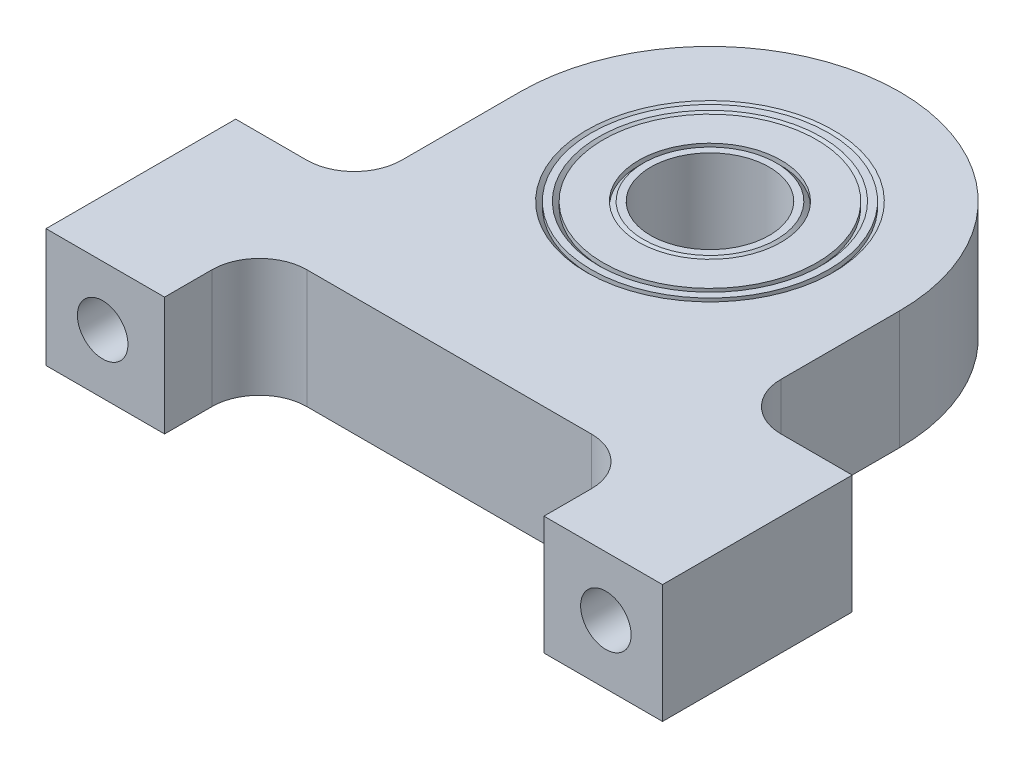
ISO-10303-21;
HEADER;
FILE_DESCRIPTION(('STEP AP214'),'2;1');
FILE_NAME('part.step','',(''),(''),'','','');
FILE_SCHEMA(('AUTOMOTIVE_DESIGN { 1 0 10303 214 1 1 1 1 }'));
ENDSEC;
DATA;
#1=APPLICATION_CONTEXT('core data for automotive mechanical design processes');
#2=APPLICATION_PROTOCOL_DEFINITION('international standard','automotive_design',2000,#1);
#3=PRODUCT_CONTEXT('',#1,'mechanical');
#4=PRODUCT('Part','Part','',(#3));
#5=PRODUCT_RELATED_PRODUCT_CATEGORY('part','',(#4));
#6=PRODUCT_DEFINITION_FORMATION('','',#4);
#7=PRODUCT_DEFINITION_CONTEXT('part definition',#1,'design');
#8=PRODUCT_DEFINITION('design','',#6,#7);
#9=PRODUCT_DEFINITION_SHAPE('','',#8);
#10=(LENGTH_UNIT() NAMED_UNIT(*) SI_UNIT(.MILLI.,.METRE.));
#11=(NAMED_UNIT(*) PLANE_ANGLE_UNIT() SI_UNIT($,.RADIAN.));
#12=(NAMED_UNIT(*) SI_UNIT($,.STERADIAN.) SOLID_ANGLE_UNIT());
#13=UNCERTAINTY_MEASURE_WITH_UNIT(LENGTH_MEASURE(1.E-05),#10,'distance_accuracy_value','');
#14=(GEOMETRIC_REPRESENTATION_CONTEXT(3) GLOBAL_UNCERTAINTY_ASSIGNED_CONTEXT((#13)) GLOBAL_UNIT_ASSIGNED_CONTEXT((#10,
#11,#12)) REPRESENTATION_CONTEXT('',''));
#15=CARTESIAN_POINT('',(0.,0.,0.));
#16=DIRECTION('',(0.,0.,1.));
#17=DIRECTION('',(1.,0.,0.));
#18=AXIS2_PLACEMENT_3D('',#15,#16,#17);
#19=CARTESIAN_POINT('',(0.,6.35,0.));
#20=DIRECTION('',(0.,-1.,0.));
#21=DIRECTION('',(0.,0.,-1.));
#22=AXIS2_PLACEMENT_3D('',#19,#20,#21);
#23=CYLINDRICAL_SURFACE('',#22,3.81);
#24=CARTESIAN_POINT('',(0.,1.8415,0.));
#25=DIRECTION('',(0.,1.,0.));
#26=DIRECTION('',(0.,0.,1.));
#27=AXIS2_PLACEMENT_3D('',#24,#25,#26);
#28=CIRCLE('',#27,3.81);
#29=CARTESIAN_POINT('',(0.,1.8415,3.81));
#30=VERTEX_POINT('',#29);
#31=EDGE_CURVE('E61',#30,#30,#28,.T.);
#32=ORIENTED_EDGE('',*,*,#31,.T.);
#33=EDGE_LOOP('',(#32));
#34=FACE_BOUND('',#33,.T.);
#35=CARTESIAN_POINT('',(0.,2.0955,0.));
#36=DIRECTION('',(0.,1.,0.));
#37=DIRECTION('',(0.,0.,1.));
#38=AXIS2_PLACEMENT_3D('',#35,#36,#37);
#39=CIRCLE('',#38,3.81);
#40=CARTESIAN_POINT('',(0.,2.0955,3.81));
#41=VERTEX_POINT('',#40);
#42=EDGE_CURVE('E11',#41,#41,#39,.T.);
#43=ORIENTED_EDGE('',*,*,#42,.F.);
#44=EDGE_LOOP('',(#43));
#45=FACE_BOUND('',#44,.T.);
#46=ADVANCED_FACE('F46',(#34,#45),#23,.T.);
#47=CARTESIAN_POINT('',(0.,6.35,0.));
#48=DIRECTION('',(0.,1.,0.));
#49=DIRECTION('',(0.,0.,1.));
#50=AXIS2_PLACEMENT_3D('',#47,#48,#49);
#51=PLANE('',#50);
#52=CARTESIAN_POINT('',(0.,6.35,0.));
#53=DIRECTION('',(0.,1.,0.));
#54=DIRECTION('',(0.,0.,1.));
#55=AXIS2_PLACEMENT_3D('',#52,#53,#54);
#56=CIRCLE('',#55,3.55600000000001);
#57=CARTESIAN_POINT('',(0.,6.35,3.55600000000001));
#58=VERTEX_POINT('',#57);
#59=EDGE_CURVE('E53',#58,#58,#56,.T.);
#60=ORIENTED_EDGE('',*,*,#59,.T.);
#61=EDGE_LOOP('',(#60));
#62=FACE_BOUND('',#61,.T.);
#63=CARTESIAN_POINT('',(0.,6.35,0.));
#64=DIRECTION('',(0.,1.,0.));
#65=DIRECTION('',(0.,0.,1.));
#66=AXIS2_PLACEMENT_3D('',#63,#64,#65);
#67=CIRCLE('',#66,3.175);
#68=CARTESIAN_POINT('',(0.,6.35,3.175));
#69=VERTEX_POINT('',#68);
#70=EDGE_CURVE('E69',#69,#69,#67,.T.);
#71=ORIENTED_EDGE('',*,*,#70,.F.);
#72=EDGE_LOOP('',(#71));
#73=FACE_BOUND('',#72,.T.);
#74=ADVANCED_FACE('F107',(#62,#73),#51,.T.);
#75=CARTESIAN_POINT('',(0.,1.5875,0.));
#76=DIRECTION('',(0.,1.,0.));
#77=DIRECTION('',(0.,0.,1.));
#78=AXIS2_PLACEMENT_3D('',#75,#76,#77);
#79=PLANE('',#78);
#80=CARTESIAN_POINT('',(0.,1.5875,0.));
#81=DIRECTION('',(0.,1.,0.));
#82=DIRECTION('',(0.,0.,1.));
#83=AXIS2_PLACEMENT_3D('',#80,#81,#82);
#84=CIRCLE('',#83,3.55599999999999);
#85=CARTESIAN_POINT('',(0.,1.5875,3.55599999999999));
#86=VERTEX_POINT('',#85);
#87=EDGE_CURVE('E57',#86,#86,#84,.F.);
#88=ORIENTED_EDGE('',*,*,#87,.T.);
#89=EDGE_LOOP('',(#88));
#90=FACE_BOUND('',#89,.T.);
#91=CARTESIAN_POINT('',(0.,1.5875,0.));
#92=DIRECTION('',(0.,1.,0.));
#93=DIRECTION('',(0.,0.,1.));
#94=AXIS2_PLACEMENT_3D('',#91,#92,#93);
#95=CIRCLE('',#94,3.175);
#96=CARTESIAN_POINT('',(0.,1.5875,3.175));
#97=VERTEX_POINT('',#96);
#98=EDGE_CURVE('E70',#97,#97,#95,.T.);
#99=ORIENTED_EDGE('',*,*,#98,.T.);
#100=EDGE_LOOP('',(#99));
#101=FACE_BOUND('',#100,.T.);
#102=ADVANCED_FACE('F113',(#90,#101),#79,.F.);
#103=CARTESIAN_POINT('',(0.,6.35,0.));
#104=DIRECTION('',(0.,-1.,0.));
#105=DIRECTION('',(0.,0.,-1.));
#106=AXIS2_PLACEMENT_3D('',#103,#104,#105);
#107=CYLINDRICAL_SURFACE('',#106,3.175);
#108=ORIENTED_EDGE('',*,*,#70,.T.);
#109=EDGE_LOOP('',(#108));
#110=FACE_BOUND('',#109,.T.);
#111=ORIENTED_EDGE('',*,*,#98,.F.);
#112=EDGE_LOOP('',(#111));
#113=FACE_BOUND('',#112,.T.);
#114=ADVANCED_FACE('F118',(#110,#113),#107,.F.);
#115=CARTESIAN_POINT('',(0.,1.8415,0.));
#116=DIRECTION('',(0.,1.,0.));
#117=DIRECTION('',(0.,0.,1.));
#118=AXIS2_PLACEMENT_3D('',#115,#116,#117);
#119=CONICAL_SURFACE('',#118,3.81,0.785398163397449);
#120=ORIENTED_EDGE('',*,*,#87,.F.);
#121=EDGE_LOOP('',(#120));
#122=FACE_BOUND('',#121,.T.);
#123=ORIENTED_EDGE('',*,*,#31,.F.);
#124=EDGE_LOOP('',(#123));
#125=FACE_BOUND('',#124,.T.);
#126=ADVANCED_FACE('F103',(#122,#125),#119,.T.);
#127=CARTESIAN_POINT('',(0.,6.35,0.));
#128=DIRECTION('',(0.,-1.,0.));
#129=DIRECTION('',(0.,0.,-1.));
#130=AXIS2_PLACEMENT_3D('',#127,#128,#129);
#131=CONICAL_SURFACE('',#130,3.55600000000001,0.785398163397447);
#132=CARTESIAN_POINT('',(0.,6.09600000000001,0.));
#133=DIRECTION('',(0.,1.,0.));
#134=DIRECTION('',(0.,0.,1.));
#135=AXIS2_PLACEMENT_3D('',#132,#133,#134);
#136=CIRCLE('',#135,3.81);
#137=CARTESIAN_POINT('',(0.,6.09600000000001,3.81));
#138=VERTEX_POINT('',#137);
#139=EDGE_CURVE('E66',#138,#138,#136,.F.);
#140=ORIENTED_EDGE('',*,*,#139,.F.);
#141=EDGE_LOOP('',(#140));
#142=FACE_BOUND('',#141,.T.);
#143=ORIENTED_EDGE('',*,*,#59,.F.);
#144=EDGE_LOOP('',(#143));
#145=FACE_BOUND('',#144,.T.);
#146=ADVANCED_FACE('F48',(#142,#145),#131,.T.);
#147=CARTESIAN_POINT('',(0.,2.0955,0.));
#148=DIRECTION('',(0.,1.,0.));
#149=DIRECTION('',(0.,0.,1.));
#150=AXIS2_PLACEMENT_3D('',#147,#148,#149);
#151=CYLINDRICAL_SURFACE('',#150,5.715);
#152=CARTESIAN_POINT('',(0.,2.0955,0.));
#153=DIRECTION('',(0.,1.,0.));
#154=DIRECTION('',(0.,0.,1.));
#155=AXIS2_PLACEMENT_3D('',#152,#153,#154);
#156=CIRCLE('',#155,5.715);
#157=CARTESIAN_POINT('',(0.,2.0955,5.715));
#158=VERTEX_POINT('',#157);
#159=EDGE_CURVE('E73',#158,#158,#156,.T.);
#160=ORIENTED_EDGE('',*,*,#159,.T.);
#161=EDGE_LOOP('',(#160));
#162=FACE_BOUND('',#161,.T.);
#163=CARTESIAN_POINT('',(0.,6.35,0.));
#164=DIRECTION('',(0.,1.,0.));
#165=DIRECTION('',(0.,0.,1.));
#166=AXIS2_PLACEMENT_3D('',#163,#164,#165);
#167=CIRCLE('',#166,5.715);
#168=CARTESIAN_POINT('',(0.,6.35,5.715));
#169=VERTEX_POINT('',#168);
#170=EDGE_CURVE('E76',#169,#169,#167,.T.);
#171=ORIENTED_EDGE('',*,*,#170,.F.);
#172=EDGE_LOOP('',(#171));
#173=FACE_BOUND('',#172,.T.);
#174=ADVANCED_FACE('F94',(#162,#173),#151,.T.);
#175=CARTESIAN_POINT('',(0.,2.0955,0.));
#176=DIRECTION('',(0.,1.,0.));
#177=DIRECTION('',(0.,0.,1.));
#178=AXIS2_PLACEMENT_3D('',#175,#176,#177);
#179=PLANE('',#178);
#180=ORIENTED_EDGE('',*,*,#42,.T.);
#181=EDGE_LOOP('',(#180));
#182=FACE_BOUND('',#181,.T.);
#183=ORIENTED_EDGE('',*,*,#159,.F.);
#184=EDGE_LOOP('',(#183));
#185=FACE_BOUND('',#184,.T.);
#186=ADVANCED_FACE('F90',(#182,#185),#179,.F.);
#187=CARTESIAN_POINT('',(0.,6.35,0.));
#188=DIRECTION('',(0.,1.,0.));
#189=DIRECTION('',(0.,0.,1.));
#190=AXIS2_PLACEMENT_3D('',#187,#188,#189);
#191=PLANE('',#190);
#192=CARTESIAN_POINT('',(0.,6.35,0.));
#193=DIRECTION('',(0.,1.,0.));
#194=DIRECTION('',(0.,0.,1.));
#195=AXIS2_PLACEMENT_3D('',#192,#193,#194);
#196=CIRCLE('',#195,3.81);
#197=CARTESIAN_POINT('',(0.,6.35,3.81));
#198=VERTEX_POINT('',#197);
#199=EDGE_CURVE('E79',#198,#198,#196,.T.);
#200=ORIENTED_EDGE('',*,*,#199,.F.);
#201=EDGE_LOOP('',(#200));
#202=FACE_BOUND('',#201,.T.);
#203=ORIENTED_EDGE('',*,*,#170,.T.);
#204=EDGE_LOOP('',(#203));
#205=FACE_BOUND('',#204,.T.);
#206=ADVANCED_FACE('F87',(#202,#205),#191,.T.);
#207=CARTESIAN_POINT('',(0.,2.0955,0.));
#208=DIRECTION('',(0.,1.,0.));
#209=DIRECTION('',(0.,0.,1.));
#210=AXIS2_PLACEMENT_3D('',#207,#208,#209);
#211=CYLINDRICAL_SURFACE('',#210,3.81);
#212=ORIENTED_EDGE('',*,*,#139,.T.);
#213=EDGE_LOOP('',(#212));
#214=FACE_BOUND('',#213,.T.);
#215=ORIENTED_EDGE('',*,*,#199,.T.);
#216=EDGE_LOOP('',(#215));
#217=FACE_BOUND('',#216,.T.);
#218=ADVANCED_FACE('F85',(#214,#217),#211,.F.);
#219=CLOSED_SHELL('',(#46,#74,#102,#114,#126,#146,#174,#186,#206,#218));
#220=MANIFOLD_SOLID_BREP('B2',#219);
#221=CARTESIAN_POINT('',(12.7,6.35,6.35));
#222=DIRECTION('',(0.,-1.,0.));
#223=DIRECTION('',(0.,0.,-1.));
#224=AXIS2_PLACEMENT_3D('',#221,#222,#223);
#225=CYLINDRICAL_SURFACE('',#224,2.54);
#226=CARTESIAN_POINT('',(12.7,0.,6.35));
#227=DIRECTION('',(0.,-1.,0.));
#228=DIRECTION('',(0.,0.,1.));
#229=AXIS2_PLACEMENT_3D('',#226,#227,#228);
#230=CIRCLE('',#229,2.54);
#231=CARTESIAN_POINT('',(12.7,0.,8.89));
#232=VERTEX_POINT('',#231);
#233=CARTESIAN_POINT('',(10.16,0.,6.34999999999998));
#234=VERTEX_POINT('',#233);
#235=EDGE_CURVE('E346',#232,#234,#230,.T.);
#236=ORIENTED_EDGE('',*,*,#235,.T.);
#237=DIRECTION('',(0.,-1.,0.));
#238=VECTOR('',#237,1.);
#239=CARTESIAN_POINT('',(10.16,6.35,6.34999999999998));
#240=LINE('',#239,#238);
#241=CARTESIAN_POINT('',(10.16,6.35,6.34999999999998));
#242=VERTEX_POINT('',#241);
#243=EDGE_CURVE('E414',#242,#234,#240,.T.);
#244=ORIENTED_EDGE('',*,*,#243,.F.);
#245=CARTESIAN_POINT('',(12.7,6.35,6.35));
#246=DIRECTION('',(0.,-1.,0.));
#247=DIRECTION('',(0.,0.,1.));
#248=AXIS2_PLACEMENT_3D('',#245,#246,#247);
#249=CIRCLE('',#248,2.54);
#250=CARTESIAN_POINT('',(12.7,6.35,8.89));
#251=VERTEX_POINT('',#250);
#252=EDGE_CURVE('E377',#251,#242,#249,.T.);
#253=ORIENTED_EDGE('',*,*,#252,.F.);
#254=DIRECTION('',(0.,-1.,0.));
#255=VECTOR('',#254,1.);
#256=CARTESIAN_POINT('',(12.7,6.35,8.89));
#257=LINE('',#256,#255);
#258=EDGE_CURVE('E342',#251,#232,#257,.T.);
#259=ORIENTED_EDGE('',*,*,#258,.T.);
#260=EDGE_LOOP('',(#236,#244,#253,#259));
#261=FACE_BOUND('',#260,.T.);
#262=ADVANCED_FACE('F197',(#261),#225,.F.);
#263=CARTESIAN_POINT('',(10.16,6.35,0.));
#264=DIRECTION('',(-1.,0.,0.));
#265=DIRECTION('',(0.,0.,1.));
#266=AXIS2_PLACEMENT_3D('',#263,#264,#265);
#267=PLANE('',#266);
#268=DIRECTION('',(0.,0.,-1.));
#269=VECTOR('',#268,1.);
#270=CARTESIAN_POINT('',(10.16,0.,0.));
#271=LINE('',#270,#269);
#272=CARTESIAN_POINT('',(10.16,0.,0.));
#273=VERTEX_POINT('',#272);
#274=EDGE_CURVE('E349',#234,#273,#271,.T.);
#275=ORIENTED_EDGE('',*,*,#274,.T.);
#276=DIRECTION('',(0.,-1.,0.));
#277=VECTOR('',#276,1.);
#278=CARTESIAN_POINT('',(10.16,6.35,0.));
#279=LINE('',#278,#277);
#280=CARTESIAN_POINT('',(10.16,6.35,0.));
#281=VERTEX_POINT('',#280);
#282=EDGE_CURVE('E411',#281,#273,#279,.T.);
#283=ORIENTED_EDGE('',*,*,#282,.F.);
#284=DIRECTION('',(0.,0.,-1.));
#285=VECTOR('',#284,1.);
#286=CARTESIAN_POINT('',(10.16,6.35,0.));
#287=LINE('',#286,#285);
#288=EDGE_CURVE('E283',#242,#281,#287,.T.);
#289=ORIENTED_EDGE('',*,*,#288,.F.);
#290=ORIENTED_EDGE('',*,*,#243,.T.);
#291=EDGE_LOOP('',(#275,#283,#289,#290));
#292=FACE_BOUND('',#291,.T.);
#293=ADVANCED_FACE('F456',(#292),#267,.F.);
#294=CARTESIAN_POINT('',(0.,6.35,0.));
#295=DIRECTION('',(0.,-1.,0.));
#296=DIRECTION('',(0.,0.,-1.));
#297=AXIS2_PLACEMENT_3D('',#294,#295,#296);
#298=CYLINDRICAL_SURFACE('',#297,10.16);
#299=CARTESIAN_POINT('',(0.,0.,0.));
#300=DIRECTION('',(0.,1.,0.));
#301=DIRECTION('',(0.,0.,1.));
#302=AXIS2_PLACEMENT_3D('',#299,#300,#301);
#303=CIRCLE('',#302,10.16);
#304=CARTESIAN_POINT('',(-10.16,0.,0.));
#305=VERTEX_POINT('',#304);
#306=EDGE_CURVE('E352',#273,#305,#303,.T.);
#307=ORIENTED_EDGE('',*,*,#306,.T.);
#308=DIRECTION('',(0.,-1.,0.));
#309=VECTOR('',#308,1.);
#310=CARTESIAN_POINT('',(-10.16,6.35,0.));
#311=LINE('',#310,#309);
#312=CARTESIAN_POINT('',(-10.16,6.35,0.));
#313=VERTEX_POINT('',#312);
#314=EDGE_CURVE('E408',#313,#305,#311,.T.);
#315=ORIENTED_EDGE('',*,*,#314,.F.);
#316=CARTESIAN_POINT('',(0.,6.35,0.));
#317=DIRECTION('',(0.,1.,0.));
#318=DIRECTION('',(0.,0.,1.));
#319=AXIS2_PLACEMENT_3D('',#316,#317,#318);
#320=CIRCLE('',#319,10.16);
#321=EDGE_CURVE('E502',#281,#313,#320,.T.);
#322=ORIENTED_EDGE('',*,*,#321,.F.);
#323=ORIENTED_EDGE('',*,*,#282,.T.);
#324=EDGE_LOOP('',(#307,#315,#322,#323));
#325=FACE_BOUND('',#324,.T.);
#326=ADVANCED_FACE('F462',(#325),#298,.T.);
#327=CARTESIAN_POINT('',(-10.16,6.35,0.));
#328=DIRECTION('',(1.,0.,0.));
#329=DIRECTION('',(0.,0.,-1.));
#330=AXIS2_PLACEMENT_3D('',#327,#328,#329);
#331=PLANE('',#330);
#332=DIRECTION('',(0.,0.,1.));
#333=VECTOR('',#332,1.);
#334=CARTESIAN_POINT('',(-10.16,0.,0.));
#335=LINE('',#334,#333);
#336=CARTESIAN_POINT('',(-10.16,0.,6.34999999999998));
#337=VERTEX_POINT('',#336);
#338=EDGE_CURVE('E354',#305,#337,#335,.T.);
#339=ORIENTED_EDGE('',*,*,#338,.T.);
#340=DIRECTION('',(0.,-1.,0.));
#341=VECTOR('',#340,1.);
#342=CARTESIAN_POINT('',(-10.16,6.35,6.34999999999998));
#343=LINE('',#342,#341);
#344=CARTESIAN_POINT('',(-10.16,6.35,6.34999999999998));
#345=VERTEX_POINT('',#344);
#346=EDGE_CURVE('E405',#345,#337,#343,.T.);
#347=ORIENTED_EDGE('',*,*,#346,.F.);
#348=DIRECTION('',(0.,0.,1.));
#349=VECTOR('',#348,1.);
#350=CARTESIAN_POINT('',(-10.16,6.35,0.));
#351=LINE('',#350,#349);
#352=EDGE_CURVE('E504',#313,#345,#351,.T.);
#353=ORIENTED_EDGE('',*,*,#352,.F.);
#354=ORIENTED_EDGE('',*,*,#314,.T.);
#355=EDGE_LOOP('',(#339,#347,#353,#354));
#356=FACE_BOUND('',#355,.T.);
#357=ADVANCED_FACE('F583',(#356),#331,.F.);
#358=CARTESIAN_POINT('',(-12.7,6.35,6.35));
#359=DIRECTION('',(0.,-1.,0.));
#360=DIRECTION('',(0.,0.,-1.));
#361=AXIS2_PLACEMENT_3D('',#358,#359,#360);
#362=CYLINDRICAL_SURFACE('',#361,2.54);
#363=CARTESIAN_POINT('',(-12.7,0.,6.35));
#364=DIRECTION('',(0.,-1.,0.));
#365=DIRECTION('',(0.,0.,-1.));
#366=AXIS2_PLACEMENT_3D('',#363,#364,#365);
#367=CIRCLE('',#366,2.54);
#368=CARTESIAN_POINT('',(-12.7,0.,8.89));
#369=VERTEX_POINT('',#368);
#370=EDGE_CURVE('E356',#337,#369,#367,.T.);
#371=ORIENTED_EDGE('',*,*,#370,.T.);
#372=DIRECTION('',(0.,-1.,0.));
#373=VECTOR('',#372,1.);
#374=CARTESIAN_POINT('',(-12.7,6.35,8.89));
#375=LINE('',#374,#373);
#376=CARTESIAN_POINT('',(-12.7,6.35,8.89));
#377=VERTEX_POINT('',#376);
#378=EDGE_CURVE('E402',#377,#369,#375,.T.);
#379=ORIENTED_EDGE('',*,*,#378,.F.);
#380=CARTESIAN_POINT('',(-12.7,6.35,6.35));
#381=DIRECTION('',(0.,-1.,0.));
#382=DIRECTION('',(0.,0.,-1.));
#383=AXIS2_PLACEMENT_3D('',#380,#381,#382);
#384=CIRCLE('',#383,2.54);
#385=EDGE_CURVE('E506',#345,#377,#384,.T.);
#386=ORIENTED_EDGE('',*,*,#385,.F.);
#387=ORIENTED_EDGE('',*,*,#346,.T.);
#388=EDGE_LOOP('',(#371,#379,#386,#387));
#389=FACE_BOUND('',#388,.T.);
#390=ADVANCED_FACE('F579',(#389),#362,.F.);
#391=CARTESIAN_POINT('',(-16.51,6.35,8.89));
#392=DIRECTION('',(0.,0.,1.));
#393=DIRECTION('',(1.,0.,0.));
#394=AXIS2_PLACEMENT_3D('',#391,#392,#393);
#395=PLANE('',#394);
#396=DIRECTION('',(-1.,0.,0.));
#397=VECTOR('',#396,1.);
#398=CARTESIAN_POINT('',(-16.51,0.,8.89));
#399=LINE('',#398,#397);
#400=CARTESIAN_POINT('',(-16.51,0.,8.89));
#401=VERTEX_POINT('',#400);
#402=EDGE_CURVE('E358',#369,#401,#399,.T.);
#403=ORIENTED_EDGE('',*,*,#402,.T.);
#404=DIRECTION('',(0.,-1.,0.));
#405=VECTOR('',#404,1.);
#406=CARTESIAN_POINT('',(-16.51,6.35,8.89));
#407=LINE('',#406,#405);
#408=CARTESIAN_POINT('',(-16.51,6.35,8.89));
#409=VERTEX_POINT('',#408);
#410=EDGE_CURVE('E399',#409,#401,#407,.T.);
#411=ORIENTED_EDGE('',*,*,#410,.F.);
#412=DIRECTION('',(-1.,0.,0.));
#413=VECTOR('',#412,1.);
#414=CARTESIAN_POINT('',(-16.51,6.35,8.89));
#415=LINE('',#414,#413);
#416=EDGE_CURVE('E508',#377,#409,#415,.T.);
#417=ORIENTED_EDGE('',*,*,#416,.F.);
#418=ORIENTED_EDGE('',*,*,#378,.T.);
#419=EDGE_LOOP('',(#403,#411,#417,#418));
#420=FACE_BOUND('',#419,.T.);
#421=ADVANCED_FACE('F575',(#420),#395,.F.);
#422=CARTESIAN_POINT('',(-16.51,6.35,19.05));
#423=DIRECTION('',(1.,0.,0.));
#424=DIRECTION('',(0.,0.,-1.));
#425=AXIS2_PLACEMENT_3D('',#422,#423,#424);
#426=PLANE('',#425);
#427=DIRECTION('',(0.,0.,1.));
#428=VECTOR('',#427,1.);
#429=CARTESIAN_POINT('',(-16.51,0.,19.05));
#430=LINE('',#429,#428);
#431=CARTESIAN_POINT('',(-16.51,0.,19.05));
#432=VERTEX_POINT('',#431);
#433=EDGE_CURVE('E360',#401,#432,#430,.T.);
#434=ORIENTED_EDGE('',*,*,#433,.T.);
#435=DIRECTION('',(0.,-1.,0.));
#436=VECTOR('',#435,1.);
#437=CARTESIAN_POINT('',(-16.51,6.35,19.05));
#438=LINE('',#437,#436);
#439=CARTESIAN_POINT('',(-16.51,6.35,19.05));
#440=VERTEX_POINT('',#439);
#441=EDGE_CURVE('E396',#440,#432,#438,.T.);
#442=ORIENTED_EDGE('',*,*,#441,.F.);
#443=DIRECTION('',(0.,0.,1.));
#444=VECTOR('',#443,1.);
#445=CARTESIAN_POINT('',(-16.51,6.35,19.05));
#446=LINE('',#445,#444);
#447=EDGE_CURVE('E510',#409,#440,#446,.T.);
#448=ORIENTED_EDGE('',*,*,#447,.F.);
#449=ORIENTED_EDGE('',*,*,#410,.T.);
#450=EDGE_LOOP('',(#434,#442,#448,#449));
#451=FACE_BOUND('',#450,.T.);
#452=ADVANCED_FACE('F571',(#451),#426,.F.);
#453=CARTESIAN_POINT('',(-16.51,6.35,19.05));
#454=DIRECTION('',(0.,0.,-1.));
#455=DIRECTION('',(-1.,0.,0.));
#456=AXIS2_PLACEMENT_3D('',#453,#454,#455);
#457=PLANE('',#456);
#458=CARTESIAN_POINT('',(-13.4747,3.175,19.05));
#459=DIRECTION('',(0.,0.,1.));
#460=DIRECTION('',(1.,0.,0.));
#461=AXIS2_PLACEMENT_3D('',#458,#459,#460);
#462=CIRCLE('',#461,1.35254999999999);
#463=CARTESIAN_POINT('',(-12.12215,3.175,19.05));
#464=VERTEX_POINT('',#463);
#465=EDGE_CURVE('E784',#464,#464,#462,.T.);
#466=ORIENTED_EDGE('',*,*,#465,.F.);
#467=EDGE_LOOP('',(#466));
#468=FACE_BOUND('',#467,.T.);
#469=DIRECTION('',(1.,0.,0.));
#470=VECTOR('',#469,1.);
#471=CARTESIAN_POINT('',(-16.51,0.,19.05));
#472=LINE('',#471,#470);
#473=CARTESIAN_POINT('',(-10.16,0.,19.05));
#474=VERTEX_POINT('',#473);
#475=EDGE_CURVE('E362',#432,#474,#472,.T.);
#476=ORIENTED_EDGE('',*,*,#475,.T.);
#477=DIRECTION('',(0.,-1.,0.));
#478=VECTOR('',#477,1.);
#479=CARTESIAN_POINT('',(-10.16,6.35,19.05));
#480=LINE('',#479,#478);
#481=CARTESIAN_POINT('',(-10.16,6.35,19.05));
#482=VERTEX_POINT('',#481);
#483=EDGE_CURVE('E393',#482,#474,#480,.T.);
#484=ORIENTED_EDGE('',*,*,#483,.F.);
#485=DIRECTION('',(1.,0.,0.));
#486=VECTOR('',#485,1.);
#487=CARTESIAN_POINT('',(-16.51,6.35,19.05));
#488=LINE('',#487,#486);
#489=EDGE_CURVE('E512',#440,#482,#488,.T.);
#490=ORIENTED_EDGE('',*,*,#489,.F.);
#491=ORIENTED_EDGE('',*,*,#441,.T.);
#492=EDGE_LOOP('',(#476,#484,#490,#491));
#493=FACE_BOUND('',#492,.T.);
#494=ADVANCED_FACE('F567',(#468,#493),#457,.F.);
#495=CARTESIAN_POINT('',(-10.16,6.35,19.05));
#496=DIRECTION('',(-1.,0.,0.));
#497=DIRECTION('',(0.,0.,1.));
#498=AXIS2_PLACEMENT_3D('',#495,#496,#497);
#499=PLANE('',#498);
#500=DIRECTION('',(0.,0.,-1.));
#501=VECTOR('',#500,1.);
#502=CARTESIAN_POINT('',(-10.16,0.,19.05));
#503=LINE('',#502,#501);
#504=CARTESIAN_POINT('',(-10.16,0.,16.51));
#505=VERTEX_POINT('',#504);
#506=EDGE_CURVE('E364',#474,#505,#503,.T.);
#507=ORIENTED_EDGE('',*,*,#506,.T.);
#508=DIRECTION('',(0.,-1.,0.));
#509=VECTOR('',#508,1.);
#510=CARTESIAN_POINT('',(-10.16,6.35,16.51));
#511=LINE('',#510,#509);
#512=CARTESIAN_POINT('',(-10.16,6.35,16.51));
#513=VERTEX_POINT('',#512);
#514=EDGE_CURVE('E390',#513,#505,#511,.T.);
#515=ORIENTED_EDGE('',*,*,#514,.F.);
#516=DIRECTION('',(0.,0.,-1.));
#517=VECTOR('',#516,1.);
#518=CARTESIAN_POINT('',(-10.16,6.35,19.05));
#519=LINE('',#518,#517);
#520=EDGE_CURVE('E514',#482,#513,#519,.T.);
#521=ORIENTED_EDGE('',*,*,#520,.F.);
#522=ORIENTED_EDGE('',*,*,#483,.T.);
#523=EDGE_LOOP('',(#507,#515,#521,#522));
#524=FACE_BOUND('',#523,.T.);
#525=ADVANCED_FACE('F563',(#524),#499,.F.);
#526=CARTESIAN_POINT('',(-7.62,6.35,16.51));
#527=DIRECTION('',(0.,-1.,0.));
#528=DIRECTION('',(0.,0.,-1.));
#529=AXIS2_PLACEMENT_3D('',#526,#527,#528);
#530=CYLINDRICAL_SURFACE('',#529,2.54);
#531=CARTESIAN_POINT('',(-7.62,0.,16.51));
#532=DIRECTION('',(0.,-1.,0.));
#533=DIRECTION('',(0.,0.,-1.));
#534=AXIS2_PLACEMENT_3D('',#531,#532,#533);
#535=CIRCLE('',#534,2.54);
#536=CARTESIAN_POINT('',(-7.61999999999998,0.,13.97));
#537=VERTEX_POINT('',#536);
#538=EDGE_CURVE('E366',#505,#537,#535,.T.);
#539=ORIENTED_EDGE('',*,*,#538,.T.);
#540=DIRECTION('',(0.,-1.,0.));
#541=VECTOR('',#540,1.);
#542=CARTESIAN_POINT('',(-7.61999999999998,6.35,13.97));
#543=LINE('',#542,#541);
#544=CARTESIAN_POINT('',(-7.61999999999998,6.35,13.97));
#545=VERTEX_POINT('',#544);
#546=EDGE_CURVE('E387',#545,#537,#543,.T.);
#547=ORIENTED_EDGE('',*,*,#546,.F.);
#548=CARTESIAN_POINT('',(-7.62,6.35,16.51));
#549=DIRECTION('',(0.,-1.,0.));
#550=DIRECTION('',(0.,0.,-1.));
#551=AXIS2_PLACEMENT_3D('',#548,#549,#550);
#552=CIRCLE('',#551,2.54);
#553=EDGE_CURVE('E516',#513,#545,#552,.T.);
#554=ORIENTED_EDGE('',*,*,#553,.F.);
#555=ORIENTED_EDGE('',*,*,#514,.T.);
#556=EDGE_LOOP('',(#539,#547,#554,#555));
#557=FACE_BOUND('',#556,.T.);
#558=ADVANCED_FACE('F559',(#557),#530,.F.);
#559=CARTESIAN_POINT('',(-7.61999999999998,6.35,13.97));
#560=DIRECTION('',(0.,0.,-1.));
#561=DIRECTION('',(-1.,0.,0.));
#562=AXIS2_PLACEMENT_3D('',#559,#560,#561);
#563=PLANE('',#562);
#564=DIRECTION('',(1.,0.,0.));
#565=VECTOR('',#564,1.);
#566=CARTESIAN_POINT('',(-7.61999999999998,0.,13.97));
#567=LINE('',#566,#565);
#568=CARTESIAN_POINT('',(7.61999999999998,0.,13.97));
#569=VERTEX_POINT('',#568);
#570=EDGE_CURVE('E368',#537,#569,#567,.T.);
#571=ORIENTED_EDGE('',*,*,#570,.T.);
#572=DIRECTION('',(0.,-1.,0.));
#573=VECTOR('',#572,1.);
#574=CARTESIAN_POINT('',(7.61999999999998,6.35,13.97));
#575=LINE('',#574,#573);
#576=CARTESIAN_POINT('',(7.61999999999998,6.35,13.97));
#577=VERTEX_POINT('',#576);
#578=EDGE_CURVE('E384',#577,#569,#575,.T.);
#579=ORIENTED_EDGE('',*,*,#578,.F.);
#580=DIRECTION('',(1.,0.,0.));
#581=VECTOR('',#580,1.);
#582=CARTESIAN_POINT('',(-7.61999999999998,6.35,13.97));
#583=LINE('',#582,#581);
#584=EDGE_CURVE('E518',#545,#577,#583,.T.);
#585=ORIENTED_EDGE('',*,*,#584,.F.);
#586=ORIENTED_EDGE('',*,*,#546,.T.);
#587=EDGE_LOOP('',(#571,#579,#585,#586));
#588=FACE_BOUND('',#587,.T.);
#589=ADVANCED_FACE('F556',(#588),#563,.F.);
#590=CARTESIAN_POINT('',(7.62,6.35,16.51));
#591=DIRECTION('',(0.,-1.,0.));
#592=DIRECTION('',(0.,0.,-1.));
#593=AXIS2_PLACEMENT_3D('',#590,#591,#592);
#594=CYLINDRICAL_SURFACE('',#593,2.54);
#595=CARTESIAN_POINT('',(7.62,0.,16.51));
#596=DIRECTION('',(0.,-1.,0.));
#597=DIRECTION('',(0.,0.,-1.));
#598=AXIS2_PLACEMENT_3D('',#595,#596,#597);
#599=CIRCLE('',#598,2.54);
#600=CARTESIAN_POINT('',(10.16,0.,16.51));
#601=VERTEX_POINT('',#600);
#602=EDGE_CURVE('E370',#569,#601,#599,.T.);
#603=ORIENTED_EDGE('',*,*,#602,.T.);
#604=DIRECTION('',(0.,-1.,0.));
#605=VECTOR('',#604,1.);
#606=CARTESIAN_POINT('',(10.16,6.35,16.51));
#607=LINE('',#606,#605);
#608=CARTESIAN_POINT('',(10.16,6.35,16.51));
#609=VERTEX_POINT('',#608);
#610=EDGE_CURVE('E381',#609,#601,#607,.T.);
#611=ORIENTED_EDGE('',*,*,#610,.F.);
#612=CARTESIAN_POINT('',(7.62,6.35,16.51));
#613=DIRECTION('',(0.,-1.,0.));
#614=DIRECTION('',(0.,0.,-1.));
#615=AXIS2_PLACEMENT_3D('',#612,#613,#614);
#616=CIRCLE('',#615,2.54);
#617=EDGE_CURVE('E520',#577,#609,#616,.T.);
#618=ORIENTED_EDGE('',*,*,#617,.F.);
#619=ORIENTED_EDGE('',*,*,#578,.T.);
#620=EDGE_LOOP('',(#603,#611,#618,#619));
#621=FACE_BOUND('',#620,.T.);
#622=ADVANCED_FACE('F526',(#621),#594,.F.);
#623=CARTESIAN_POINT('',(10.16,6.35,16.51));
#624=DIRECTION('',(1.,0.,0.));
#625=DIRECTION('',(0.,0.,-1.));
#626=AXIS2_PLACEMENT_3D('',#623,#624,#625);
#627=PLANE('',#626);
#628=DIRECTION('',(0.,0.,1.));
#629=VECTOR('',#628,1.);
#630=CARTESIAN_POINT('',(10.16,0.,16.51));
#631=LINE('',#630,#629);
#632=CARTESIAN_POINT('',(10.16,0.,19.05));
#633=VERTEX_POINT('',#632);
#634=EDGE_CURVE('E372',#601,#633,#631,.T.);
#635=ORIENTED_EDGE('',*,*,#634,.T.);
#636=DIRECTION('',(0.,-1.,0.));
#637=VECTOR('',#636,1.);
#638=CARTESIAN_POINT('',(10.16,6.35,19.05));
#639=LINE('',#638,#637);
#640=CARTESIAN_POINT('',(10.16,6.35,19.05));
#641=VERTEX_POINT('',#640);
#642=EDGE_CURVE('E337',#641,#633,#639,.T.);
#643=ORIENTED_EDGE('',*,*,#642,.F.);
#644=DIRECTION('',(0.,0.,1.));
#645=VECTOR('',#644,1.);
#646=CARTESIAN_POINT('',(10.16,6.35,16.51));
#647=LINE('',#646,#645);
#648=EDGE_CURVE('E328',#609,#641,#647,.T.);
#649=ORIENTED_EDGE('',*,*,#648,.F.);
#650=ORIENTED_EDGE('',*,*,#610,.T.);
#651=EDGE_LOOP('',(#635,#643,#649,#650));
#652=FACE_BOUND('',#651,.T.);
#653=ADVANCED_FACE('F530',(#652),#627,.F.);
#654=CARTESIAN_POINT('',(10.16,6.35,19.05));
#655=DIRECTION('',(0.,0.,-1.));
#656=DIRECTION('',(-1.,0.,0.));
#657=AXIS2_PLACEMENT_3D('',#654,#655,#656);
#658=PLANE('',#657);
#659=CARTESIAN_POINT('',(13.4747,3.175,19.05));
#660=DIRECTION('',(0.,0.,1.));
#661=DIRECTION('',(1.,0.,0.));
#662=AXIS2_PLACEMENT_3D('',#659,#660,#661);
#663=CIRCLE('',#662,1.35254999999999);
#664=CARTESIAN_POINT('',(14.82725,3.175,19.05));
#665=VERTEX_POINT('',#664);
#666=EDGE_CURVE('E494',#665,#665,#663,.T.);
#667=ORIENTED_EDGE('',*,*,#666,.F.);
#668=EDGE_LOOP('',(#667));
#669=FACE_BOUND('',#668,.T.);
#670=DIRECTION('',(1.,0.,0.));
#671=VECTOR('',#670,1.);
#672=CARTESIAN_POINT('',(10.16,0.,19.05));
#673=LINE('',#672,#671);
#674=CARTESIAN_POINT('',(16.51,0.,19.05));
#675=VERTEX_POINT('',#674);
#676=EDGE_CURVE('E336',#633,#675,#673,.T.);
#677=ORIENTED_EDGE('',*,*,#676,.T.);
#678=DIRECTION('',(0.,-1.,0.));
#679=VECTOR('',#678,1.);
#680=CARTESIAN_POINT('',(16.51,6.35,19.05));
#681=LINE('',#680,#679);
#682=CARTESIAN_POINT('',(16.51,6.35,19.05));
#683=VERTEX_POINT('',#682);
#684=EDGE_CURVE('E333',#683,#675,#681,.T.);
#685=ORIENTED_EDGE('',*,*,#684,.F.);
#686=DIRECTION('',(1.,0.,0.));
#687=VECTOR('',#686,1.);
#688=CARTESIAN_POINT('',(10.16,6.35,19.05));
#689=LINE('',#688,#687);
#690=EDGE_CURVE('E322',#641,#683,#689,.T.);
#691=ORIENTED_EDGE('',*,*,#690,.F.);
#692=ORIENTED_EDGE('',*,*,#642,.T.);
#693=EDGE_LOOP('',(#677,#685,#691,#692));
#694=FACE_BOUND('',#693,.T.);
#695=ADVANCED_FACE('F334',(#669,#694),#658,.F.);
#696=CARTESIAN_POINT('',(16.51,6.35,19.05));
#697=DIRECTION('',(-1.,0.,0.));
#698=DIRECTION('',(0.,0.,1.));
#699=AXIS2_PLACEMENT_3D('',#696,#697,#698);
#700=PLANE('',#699);
#701=DIRECTION('',(0.,0.,-1.));
#702=VECTOR('',#701,1.);
#703=CARTESIAN_POINT('',(16.51,0.,19.05));
#704=LINE('',#703,#702);
#705=CARTESIAN_POINT('',(16.51,0.,8.89));
#706=VERTEX_POINT('',#705);
#707=EDGE_CURVE('E268',#675,#706,#704,.T.);
#708=ORIENTED_EDGE('',*,*,#707,.T.);
#709=DIRECTION('',(0.,-1.,0.));
#710=VECTOR('',#709,1.);
#711=CARTESIAN_POINT('',(16.51,6.35,8.89));
#712=LINE('',#711,#710);
#713=CARTESIAN_POINT('',(16.51,6.35,8.89));
#714=VERTEX_POINT('',#713);
#715=EDGE_CURVE('E338',#714,#706,#712,.T.);
#716=ORIENTED_EDGE('',*,*,#715,.F.);
#717=DIRECTION('',(0.,0.,-1.));
#718=VECTOR('',#717,1.);
#719=CARTESIAN_POINT('',(16.51,6.35,19.05));
#720=LINE('',#719,#718);
#721=EDGE_CURVE('E326',#683,#714,#720,.T.);
#722=ORIENTED_EDGE('',*,*,#721,.F.);
#723=ORIENTED_EDGE('',*,*,#684,.T.);
#724=EDGE_LOOP('',(#708,#716,#722,#723));
#725=FACE_BOUND('',#724,.T.);
#726=ADVANCED_FACE('F340',(#725),#700,.F.);
#727=CARTESIAN_POINT('',(12.7,6.35,8.89));
#728=DIRECTION('',(0.,0.,1.));
#729=DIRECTION('',(1.,0.,0.));
#730=AXIS2_PLACEMENT_3D('',#727,#728,#729);
#731=PLANE('',#730);
#732=DIRECTION('',(-1.,0.,0.));
#733=VECTOR('',#732,1.);
#734=CARTESIAN_POINT('',(12.7,0.,8.89));
#735=LINE('',#734,#733);
#736=EDGE_CURVE('E274',#706,#232,#735,.T.);
#737=ORIENTED_EDGE('',*,*,#736,.T.);
#738=ORIENTED_EDGE('',*,*,#258,.F.);
#739=DIRECTION('',(-1.,0.,0.));
#740=VECTOR('',#739,1.);
#741=CARTESIAN_POINT('',(12.7,6.35,8.89));
#742=LINE('',#741,#740);
#743=EDGE_CURVE('E214',#714,#251,#742,.T.);
#744=ORIENTED_EDGE('',*,*,#743,.F.);
#745=ORIENTED_EDGE('',*,*,#715,.T.);
#746=EDGE_LOOP('',(#737,#738,#744,#745));
#747=FACE_BOUND('',#746,.T.);
#748=ADVANCED_FACE('F537',(#747),#731,.F.);
#749=CARTESIAN_POINT('',(12.7,6.35,6.35));
#750=DIRECTION('',(0.,1.,0.));
#751=DIRECTION('',(0.,0.,1.));
#752=AXIS2_PLACEMENT_3D('',#749,#750,#751);
#753=PLANE('',#752);
#754=CARTESIAN_POINT('',(0.,6.35,0.));
#755=DIRECTION('',(0.,1.,0.));
#756=DIRECTION('',(0.,0.,1.));
#757=AXIS2_PLACEMENT_3D('',#754,#755,#756);
#758=CIRCLE('',#757,6.60400000000003);
#759=CARTESIAN_POINT('',(0.,6.35,6.60400000000003));
#760=VERTEX_POINT('',#759);
#761=EDGE_CURVE('E419',#760,#760,#758,.F.);
#762=ORIENTED_EDGE('',*,*,#761,.T.);
#763=EDGE_LOOP('',(#762));
#764=FACE_BOUND('',#763,.T.);
#765=ORIENTED_EDGE('',*,*,#252,.T.);
#766=ORIENTED_EDGE('',*,*,#288,.T.);
#767=ORIENTED_EDGE('',*,*,#321,.T.);
#768=ORIENTED_EDGE('',*,*,#352,.T.);
#769=ORIENTED_EDGE('',*,*,#385,.T.);
#770=ORIENTED_EDGE('',*,*,#416,.T.);
#771=ORIENTED_EDGE('',*,*,#447,.T.);
#772=ORIENTED_EDGE('',*,*,#489,.T.);
#773=ORIENTED_EDGE('',*,*,#520,.T.);
#774=ORIENTED_EDGE('',*,*,#553,.T.);
#775=ORIENTED_EDGE('',*,*,#584,.T.);
#776=ORIENTED_EDGE('',*,*,#617,.T.);
#777=ORIENTED_EDGE('',*,*,#648,.T.);
#778=ORIENTED_EDGE('',*,*,#690,.T.);
#779=ORIENTED_EDGE('',*,*,#721,.T.);
#780=ORIENTED_EDGE('',*,*,#743,.T.);
#781=EDGE_LOOP('',(#765,#766,#767,#768,#769,#770,#771,#772,#773,#774,#775,#776,#777,#778,#779,#780));
#782=FACE_BOUND('',#781,.T.);
#783=ADVANCED_FACE('F324',(#764,#782),#753,.T.);
#784=CARTESIAN_POINT('',(12.7,0.,6.35));
#785=DIRECTION('',(0.,1.,0.));
#786=DIRECTION('',(0.,0.,1.));
#787=AXIS2_PLACEMENT_3D('',#784,#785,#786);
#788=PLANE('',#787);
#789=CARTESIAN_POINT('',(0.,0.,0.));
#790=DIRECTION('',(0.,1.,0.));
#791=DIRECTION('',(0.,0.,1.));
#792=AXIS2_PLACEMENT_3D('',#789,#790,#791);
#793=CIRCLE('',#792,5.08);
#794=CARTESIAN_POINT('',(0.,0.,5.08));
#795=VERTEX_POINT('',#794);
#796=EDGE_CURVE('E350',#795,#795,#793,.F.);
#797=ORIENTED_EDGE('',*,*,#796,.F.);
#798=EDGE_LOOP('',(#797));
#799=FACE_BOUND('',#798,.T.);
#800=ORIENTED_EDGE('',*,*,#235,.F.);
#801=ORIENTED_EDGE('',*,*,#736,.F.);
#802=ORIENTED_EDGE('',*,*,#707,.F.);
#803=ORIENTED_EDGE('',*,*,#676,.F.);
#804=ORIENTED_EDGE('',*,*,#634,.F.);
#805=ORIENTED_EDGE('',*,*,#602,.F.);
#806=ORIENTED_EDGE('',*,*,#570,.F.);
#807=ORIENTED_EDGE('',*,*,#538,.F.);
#808=ORIENTED_EDGE('',*,*,#506,.F.);
#809=ORIENTED_EDGE('',*,*,#475,.F.);
#810=ORIENTED_EDGE('',*,*,#433,.F.);
#811=ORIENTED_EDGE('',*,*,#402,.F.);
#812=ORIENTED_EDGE('',*,*,#370,.F.);
#813=ORIENTED_EDGE('',*,*,#338,.F.);
#814=ORIENTED_EDGE('',*,*,#306,.F.);
#815=ORIENTED_EDGE('',*,*,#274,.F.);
#816=EDGE_LOOP('',(#800,#801,#802,#803,#804,#805,#806,#807,#808,#809,#810,#811,#812,#813,#814,#815));
#817=FACE_BOUND('',#816,.T.);
#818=ADVANCED_FACE('F533',(#799,#817),#788,.F.);
#819=CARTESIAN_POINT('',(0.,1.5875,0.));
#820=DIRECTION('',(0.,1.,0.));
#821=DIRECTION('',(0.,0.,1.));
#822=AXIS2_PLACEMENT_3D('',#819,#820,#821);
#823=PLANE('',#822);
#824=CARTESIAN_POINT('',(0.,1.5875,0.));
#825=DIRECTION('',(0.,1.,0.));
#826=DIRECTION('',(0.,0.,1.));
#827=AXIS2_PLACEMENT_3D('',#824,#825,#826);
#828=CIRCLE('',#827,5.46099999999998);
#829=CARTESIAN_POINT('',(0.,1.5875,5.46099999999998));
#830=VERTEX_POINT('',#829);
#831=EDGE_CURVE('E44',#830,#830,#828,.T.);
#832=ORIENTED_EDGE('',*,*,#831,.T.);
#833=EDGE_LOOP('',(#832));
#834=FACE_BOUND('',#833,.T.);
#835=CARTESIAN_POINT('',(0.,1.5875,0.));
#836=DIRECTION('',(0.,1.,0.));
#837=DIRECTION('',(0.,0.,1.));
#838=AXIS2_PLACEMENT_3D('',#835,#836,#837);
#839=CIRCLE('',#838,5.08);
#840=CARTESIAN_POINT('',(0.,1.5875,5.08));
#841=VERTEX_POINT('',#840);
#842=EDGE_CURVE('E488',#841,#841,#839,.T.);
#843=ORIENTED_EDGE('',*,*,#842,.F.);
#844=EDGE_LOOP('',(#843));
#845=FACE_BOUND('',#844,.T.);
#846=ADVANCED_FACE('F475',(#834,#845),#823,.T.);
#847=CARTESIAN_POINT('',(0.,-0.000999999999999916,0.));
#848=DIRECTION('',(0.,1.,0.));
#849=DIRECTION('',(0.,0.,1.));
#850=AXIS2_PLACEMENT_3D('',#847,#848,#849);
#851=CYLINDRICAL_SURFACE('',#850,5.08);
#852=ORIENTED_EDGE('',*,*,#842,.T.);
#853=EDGE_LOOP('',(#852));
#854=FACE_BOUND('',#853,.T.);
#855=ORIENTED_EDGE('',*,*,#796,.T.);
#856=EDGE_LOOP('',(#855));
#857=FACE_BOUND('',#856,.T.);
#858=ADVANCED_FACE('F468',(#854,#857),#851,.F.);
#859=CARTESIAN_POINT('',(0.,6.09599999999997,0.));
#860=DIRECTION('',(0.,1.,0.));
#861=DIRECTION('',(0.,0.,1.));
#862=AXIS2_PLACEMENT_3D('',#859,#860,#861);
#863=CONICAL_SURFACE('',#862,6.35,0.785398163397462);
#864=ORIENTED_EDGE('',*,*,#761,.F.);
#865=EDGE_LOOP('',(#864));
#866=FACE_BOUND('',#865,.T.);
#867=CARTESIAN_POINT('',(0.,6.09599999999997,0.));
#868=DIRECTION('',(0.,1.,0.));
#869=DIRECTION('',(0.,0.,1.));
#870=AXIS2_PLACEMENT_3D('',#867,#868,#869);
#871=CIRCLE('',#870,6.35);
#872=CARTESIAN_POINT('',(0.,6.09599999999997,6.35));
#873=VERTEX_POINT('',#872);
#874=EDGE_CURVE('E416',#873,#873,#871,.T.);
#875=ORIENTED_EDGE('',*,*,#874,.F.);
#876=EDGE_LOOP('',(#875));
#877=FACE_BOUND('',#876,.T.);
#878=ADVANCED_FACE('F466',(#866,#877),#863,.F.);
#879=CARTESIAN_POINT('',(0.,6.35,0.));
#880=DIRECTION('',(0.,1.,0.));
#881=DIRECTION('',(0.,0.,1.));
#882=AXIS2_PLACEMENT_3D('',#879,#880,#881);
#883=PLANE('',#882);
#884=CARTESIAN_POINT('',(0.,6.35,0.));
#885=DIRECTION('',(0.,1.,0.));
#886=DIRECTION('',(0.,0.,1.));
#887=AXIS2_PLACEMENT_3D('',#884,#885,#886);
#888=CIRCLE('',#887,5.96900000000003);
#889=CARTESIAN_POINT('',(0.,6.35,5.96900000000003));
#890=VERTEX_POINT('',#889);
#891=EDGE_CURVE('E206',#890,#890,#888,.F.);
#892=ORIENTED_EDGE('',*,*,#891,.T.);
#893=EDGE_LOOP('',(#892));
#894=FACE_BOUND('',#893,.T.);
#895=CARTESIAN_POINT('',(0.,6.35,0.));
#896=DIRECTION('',(0.,1.,0.));
#897=DIRECTION('',(0.,0.,1.));
#898=AXIS2_PLACEMENT_3D('',#895,#896,#897);
#899=CIRCLE('',#898,6.35);
#900=CARTESIAN_POINT('',(0.,6.35,6.35));
#901=VERTEX_POINT('',#900);
#902=EDGE_CURVE('E487',#901,#901,#899,.T.);
#903=ORIENTED_EDGE('',*,*,#902,.T.);
#904=EDGE_LOOP('',(#903));
#905=FACE_BOUND('',#904,.T.);
#906=ADVANCED_FACE('F430',(#894,#905),#883,.T.);
#907=CARTESIAN_POINT('',(0.,6.35,0.));
#908=DIRECTION('',(0.,-1.,0.));
#909=DIRECTION('',(0.,0.,-1.));
#910=AXIS2_PLACEMENT_3D('',#907,#908,#909);
#911=CYLINDRICAL_SURFACE('',#910,6.35);
#912=ORIENTED_EDGE('',*,*,#874,.T.);
#913=EDGE_LOOP('',(#912));
#914=FACE_BOUND('',#913,.T.);
#915=ORIENTED_EDGE('',*,*,#902,.F.);
#916=EDGE_LOOP('',(#915));
#917=FACE_BOUND('',#916,.T.);
#918=ADVANCED_FACE('F441',(#914,#917),#911,.T.);
#919=CARTESIAN_POINT('',(0.,6.35,0.));
#920=DIRECTION('',(0.,-1.,0.));
#921=DIRECTION('',(0.,0.,-1.));
#922=AXIS2_PLACEMENT_3D('',#919,#920,#921);
#923=CYLINDRICAL_SURFACE('',#922,5.715);
#924=CARTESIAN_POINT('',(0.,6.09599999999997,0.));
#925=DIRECTION('',(0.,1.,0.));
#926=DIRECTION('',(0.,0.,1.));
#927=AXIS2_PLACEMENT_3D('',#924,#925,#926);
#928=CIRCLE('',#927,5.715);
#929=CARTESIAN_POINT('',(0.,6.09599999999997,5.715));
#930=VERTEX_POINT('',#929);
#931=EDGE_CURVE('E425',#930,#930,#928,.T.);
#932=ORIENTED_EDGE('',*,*,#931,.T.);
#933=EDGE_LOOP('',(#932));
#934=FACE_BOUND('',#933,.T.);
#935=CARTESIAN_POINT('',(0.,1.84150000000002,0.));
#936=DIRECTION('',(0.,1.,0.));
#937=DIRECTION('',(0.,0.,1.));
#938=AXIS2_PLACEMENT_3D('',#935,#936,#937);
#939=CIRCLE('',#938,5.715);
#940=CARTESIAN_POINT('',(0.,1.84150000000002,5.715));
#941=VERTEX_POINT('',#940);
#942=EDGE_CURVE('E422',#941,#941,#939,.F.);
#943=ORIENTED_EDGE('',*,*,#942,.T.);
#944=EDGE_LOOP('',(#943));
#945=FACE_BOUND('',#944,.T.);
#946=ADVANCED_FACE('F436',(#934,#945),#923,.F.);
#947=CARTESIAN_POINT('',(0.,6.09599999999997,0.));
#948=DIRECTION('',(0.,1.,0.));
#949=DIRECTION('',(0.,0.,1.));
#950=AXIS2_PLACEMENT_3D('',#947,#948,#949);
#951=CONICAL_SURFACE('',#950,5.715,0.785398163397452);
#952=ORIENTED_EDGE('',*,*,#891,.F.);
#953=EDGE_LOOP('',(#952));
#954=FACE_BOUND('',#953,.T.);
#955=ORIENTED_EDGE('',*,*,#931,.F.);
#956=EDGE_LOOP('',(#955));
#957=FACE_BOUND('',#956,.T.);
#958=ADVANCED_FACE('F433',(#954,#957),#951,.F.);
#959=CARTESIAN_POINT('',(0.,1.84150000000002,0.));
#960=DIRECTION('',(0.,1.,0.));
#961=DIRECTION('',(0.,0.,1.));
#962=AXIS2_PLACEMENT_3D('',#959,#960,#961);
#963=CONICAL_SURFACE('',#962,5.715,0.785398163397447);
#964=ORIENTED_EDGE('',*,*,#831,.F.);
#965=EDGE_LOOP('',(#964));
#966=FACE_BOUND('',#965,.T.);
#967=ORIENTED_EDGE('',*,*,#942,.F.);
#968=EDGE_LOOP('',(#967));
#969=FACE_BOUND('',#968,.T.);
#970=ADVANCED_FACE('F199',(#966,#969),#963,.F.);
#971=CARTESIAN_POINT('',(13.4747,3.175,11.43));
#972=DIRECTION('',(0.,0.,1.));
#973=DIRECTION('',(1.,0.,0.));
#974=AXIS2_PLACEMENT_3D('',#971,#972,#973);
#975=CONICAL_SURFACE('',#974,1.35255,1.02974425867665);
#976=CARTESIAN_POINT('',(13.4747,3.175,10.6173059697343));
#977=VERTEX_POINT('',#976);
#978=VERTEX_LOOP('',#977);
#979=FACE_BOUND('',#978,.T.);
#980=CARTESIAN_POINT('',(13.4747,3.175,11.43));
#981=DIRECTION('',(0.,0.,1.));
#982=DIRECTION('',(1.,0.,0.));
#983=AXIS2_PLACEMENT_3D('',#980,#981,#982);
#984=CIRCLE('',#983,1.35255);
#985=CARTESIAN_POINT('',(14.82725,3.175,11.43));
#986=VERTEX_POINT('',#985);
#987=EDGE_CURVE('E489',#986,#986,#984,.T.);
#988=ORIENTED_EDGE('',*,*,#987,.T.);
#989=EDGE_LOOP('',(#988));
#990=FACE_BOUND('',#989,.T.);
#991=ADVANCED_FACE('F446',(#979,#990),#975,.F.);
#992=CARTESIAN_POINT('',(13.4747,3.175,19.05));
#993=DIRECTION('',(0.,0.,1.));
#994=DIRECTION('',(1.,0.,0.));
#995=AXIS2_PLACEMENT_3D('',#992,#993,#994);
#996=CYLINDRICAL_SURFACE('',#995,1.35254999999999);
#997=ORIENTED_EDGE('',*,*,#987,.F.);
#998=EDGE_LOOP('',(#997));
#999=FACE_BOUND('',#998,.T.);
#1000=ORIENTED_EDGE('',*,*,#666,.T.);
#1001=EDGE_LOOP('',(#1000));
#1002=FACE_BOUND('',#1001,.T.);
#1003=ADVANCED_FACE('F451',(#999,#1002),#996,.F.);
#1004=CARTESIAN_POINT('',(-13.4747,3.175,11.43));
#1005=DIRECTION('',(0.,0.,1.));
#1006=DIRECTION('',(1.,0.,0.));
#1007=AXIS2_PLACEMENT_3D('',#1004,#1005,#1006);
#1008=CONICAL_SURFACE('',#1007,1.35255,1.02974425867665);
#1009=CARTESIAN_POINT('',(-13.4747,3.175,10.6173059697343));
#1010=VERTEX_POINT('',#1009);
#1011=VERTEX_LOOP('',#1010);
#1012=FACE_BOUND('',#1011,.T.);
#1013=CARTESIAN_POINT('',(-13.4747,3.175,11.43));
#1014=DIRECTION('',(0.,0.,1.));
#1015=DIRECTION('',(1.,0.,0.));
#1016=AXIS2_PLACEMENT_3D('',#1013,#1014,#1015);
#1017=CIRCLE('',#1016,1.35255);
#1018=CARTESIAN_POINT('',(-12.12215,3.175,11.43));
#1019=VERTEX_POINT('',#1018);
#1020=EDGE_CURVE('E781',#1019,#1019,#1017,.T.);
#1021=ORIENTED_EDGE('',*,*,#1020,.T.);
#1022=EDGE_LOOP('',(#1021));
#1023=FACE_BOUND('',#1022,.T.);
#1024=ADVANCED_FACE('F746',(#1012,#1023),#1008,.F.);
#1025=CARTESIAN_POINT('',(-13.4747,3.175,19.05));
#1026=DIRECTION('',(0.,0.,1.));
#1027=DIRECTION('',(1.,0.,0.));
#1028=AXIS2_PLACEMENT_3D('',#1025,#1026,#1027);
#1029=CYLINDRICAL_SURFACE('',#1028,1.35254999999999);
#1030=ORIENTED_EDGE('',*,*,#1020,.F.);
#1031=EDGE_LOOP('',(#1030));
#1032=FACE_BOUND('',#1031,.T.);
#1033=ORIENTED_EDGE('',*,*,#465,.T.);
#1034=EDGE_LOOP('',(#1033));
#1035=FACE_BOUND('',#1034,.T.);
#1036=ADVANCED_FACE('F756',(#1032,#1035),#1029,.F.);
#1037=CLOSED_SHELL('',(#262,#293,#326,#357,#390,#421,#452,#494,#525,#558,#589,#622,#653,#695,
#726,#748,#783,#818,#846,#858,#878,#906,#918,#946,#958,#970,#991,#1003,#1024,#1036));
#1038=MANIFOLD_SOLID_BREP('B6',#1037);
#1039=ADVANCED_BREP_SHAPE_REPRESENTATION('',(#18,#220,#1038),#14);
#1040=SHAPE_DEFINITION_REPRESENTATION(#9,#1039);
ENDSEC;
END-ISO-10303-21;
